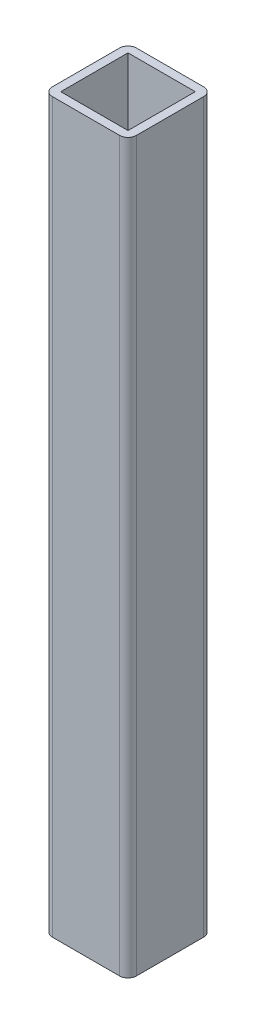
ISO-10303-21;
HEADER;
FILE_DESCRIPTION(('STEP AP214'),'2;1');
FILE_NAME('part.step','',(''),(''),'','','');
FILE_SCHEMA(('AUTOMOTIVE_DESIGN { 1 0 10303 214 1 1 1 1 }'));
ENDSEC;
DATA;
#1=APPLICATION_CONTEXT('core data for automotive mechanical design processes');
#2=APPLICATION_PROTOCOL_DEFINITION('international standard','automotive_design',2000,#1);
#3=PRODUCT_CONTEXT('',#1,'mechanical');
#4=PRODUCT('Part','Part','',(#3));
#5=PRODUCT_RELATED_PRODUCT_CATEGORY('part','',(#4));
#6=PRODUCT_DEFINITION_FORMATION('','',#4);
#7=PRODUCT_DEFINITION_CONTEXT('part definition',#1,'design');
#8=PRODUCT_DEFINITION('design','',#6,#7);
#9=PRODUCT_DEFINITION_SHAPE('','',#8);
#10=(LENGTH_UNIT() NAMED_UNIT(*) SI_UNIT(.MILLI.,.METRE.));
#11=(NAMED_UNIT(*) PLANE_ANGLE_UNIT() SI_UNIT($,.RADIAN.));
#12=(NAMED_UNIT(*) SI_UNIT($,.STERADIAN.) SOLID_ANGLE_UNIT());
#13=UNCERTAINTY_MEASURE_WITH_UNIT(LENGTH_MEASURE(1.E-05),#10,'distance_accuracy_value','');
#14=(GEOMETRIC_REPRESENTATION_CONTEXT(3) GLOBAL_UNCERTAINTY_ASSIGNED_CONTEXT((#13)) GLOBAL_UNIT_ASSIGNED_CONTEXT((#10,
#11,#12)) REPRESENTATION_CONTEXT('',''));
#15=CARTESIAN_POINT('',(0.,0.,0.));
#16=DIRECTION('',(0.,0.,1.));
#17=DIRECTION('',(1.,0.,0.));
#18=AXIS2_PLACEMENT_3D('',#15,#16,#17);
#19=CARTESIAN_POINT('',(-12.,387.934536743125,-53.1201374153035));
#20=DIRECTION('',(0.,1.,0.));
#21=DIRECTION('',(0.,0.,1.));
#22=AXIS2_PLACEMENT_3D('',#19,#20,#21);
#23=CYLINDRICAL_SURFACE('',#22,3.);
#24=CARTESIAN_POINT('',(-12.,647.649993896484,-53.1201374153035));
#25=DIRECTION('',(0.,1.,0.));
#26=DIRECTION('',(0.,0.,1.));
#27=AXIS2_PLACEMENT_3D('',#24,#25,#26);
#28=CIRCLE('',#27,3.);
#29=CARTESIAN_POINT('',(-15.,647.649993896484,-53.1201374153035));
#30=VERTEX_POINT('',#29);
#31=CARTESIAN_POINT('',(-12.,647.649993896484,-50.1201374153035));
#32=VERTEX_POINT('',#31);
#33=EDGE_CURVE('E155',#30,#32,#28,.T.);
#34=ORIENTED_EDGE('',*,*,#33,.F.);
#35=DIRECTION('',(0.,1.,0.));
#36=VECTOR('',#35,1.);
#37=CARTESIAN_POINT('',(-15.,387.934536743125,-53.1201374153035));
#38=LINE('',#37,#36);
#39=CARTESIAN_POINT('',(-15.,387.934536743125,-53.1201374153035));
#40=VERTEX_POINT('',#39);
#41=EDGE_CURVE('E11',#40,#30,#38,.T.);
#42=ORIENTED_EDGE('',*,*,#41,.F.);
#43=CARTESIAN_POINT('',(-12.,387.934536743125,-53.1201374153035));
#44=DIRECTION('',(0.,1.,0.));
#45=DIRECTION('',(0.,0.,1.));
#46=AXIS2_PLACEMENT_3D('',#43,#44,#45);
#47=CIRCLE('',#46,3.);
#48=CARTESIAN_POINT('',(-12.,387.934536743125,-50.1201374153035));
#49=VERTEX_POINT('',#48);
#50=EDGE_CURVE('E159',#40,#49,#47,.T.);
#51=ORIENTED_EDGE('',*,*,#50,.T.);
#52=DIRECTION('',(0.,1.,0.));
#53=VECTOR('',#52,1.);
#54=CARTESIAN_POINT('',(-12.,387.934536743125,-50.1201374153035));
#55=LINE('',#54,#53);
#56=EDGE_CURVE('E36',#49,#32,#55,.T.);
#57=ORIENTED_EDGE('',*,*,#56,.T.);
#58=EDGE_LOOP('',(#34,#42,#51,#57));
#59=FACE_BOUND('',#58,.T.);
#60=ADVANCED_FACE('F33',(#59),#23,.T.);
#61=CARTESIAN_POINT('',(-15.,387.934536743125,-77.1201374153035));
#62=DIRECTION('',(-1.,0.,0.));
#63=DIRECTION('',(0.,0.,1.));
#64=AXIS2_PLACEMENT_3D('',#61,#62,#63);
#65=PLANE('',#64);
#66=DIRECTION('',(0.,0.,1.));
#67=VECTOR('',#66,1.);
#68=CARTESIAN_POINT('',(-15.,647.649993896484,-77.1201374153035));
#69=LINE('',#68,#67);
#70=CARTESIAN_POINT('',(-15.,647.649993896484,-77.1201374153035));
#71=VERTEX_POINT('',#70);
#72=EDGE_CURVE('E163',#71,#30,#69,.T.);
#73=ORIENTED_EDGE('',*,*,#72,.F.);
#74=DIRECTION('',(0.,1.,0.));
#75=VECTOR('',#74,1.);
#76=CARTESIAN_POINT('',(-15.,387.934536743125,-77.1201374153035));
#77=LINE('',#76,#75);
#78=CARTESIAN_POINT('',(-15.,387.934536743125,-77.1201374153035));
#79=VERTEX_POINT('',#78);
#80=EDGE_CURVE('E41',#79,#71,#77,.T.);
#81=ORIENTED_EDGE('',*,*,#80,.F.);
#82=DIRECTION('',(0.,0.,1.));
#83=VECTOR('',#82,1.);
#84=CARTESIAN_POINT('',(-15.,387.934536743125,-77.1201374153035));
#85=LINE('',#84,#83);
#86=EDGE_CURVE('E181',#79,#40,#85,.T.);
#87=ORIENTED_EDGE('',*,*,#86,.T.);
#88=ORIENTED_EDGE('',*,*,#41,.T.);
#89=EDGE_LOOP('',(#73,#81,#87,#88));
#90=FACE_BOUND('',#89,.T.);
#91=ADVANCED_FACE('F228',(#90),#65,.T.);
#92=CARTESIAN_POINT('',(-12.,387.934536743125,-77.1201374153035));
#93=DIRECTION('',(0.,1.,0.));
#94=DIRECTION('',(0.,0.,1.));
#95=AXIS2_PLACEMENT_3D('',#92,#93,#94);
#96=CYLINDRICAL_SURFACE('',#95,2.99999999999999);
#97=CARTESIAN_POINT('',(-12.,647.649993896484,-77.1201374153035));
#98=DIRECTION('',(0.,1.,0.));
#99=DIRECTION('',(0.,0.,1.));
#100=AXIS2_PLACEMENT_3D('',#97,#98,#99);
#101=CIRCLE('',#100,2.99999999999999);
#102=CARTESIAN_POINT('',(-12.,647.649993896484,-80.1201374153035));
#103=VERTEX_POINT('',#102);
#104=EDGE_CURVE('E201',#103,#71,#101,.T.);
#105=ORIENTED_EDGE('',*,*,#104,.F.);
#106=DIRECTION('',(0.,1.,0.));
#107=VECTOR('',#106,1.);
#108=CARTESIAN_POINT('',(-12.,387.934536743125,-80.1201374153035));
#109=LINE('',#108,#107);
#110=CARTESIAN_POINT('',(-12.,387.934536743125,-80.1201374153035));
#111=VERTEX_POINT('',#110);
#112=EDGE_CURVE('E207',#111,#103,#109,.T.);
#113=ORIENTED_EDGE('',*,*,#112,.F.);
#114=CARTESIAN_POINT('',(-12.,387.934536743125,-77.1201374153035));
#115=DIRECTION('',(0.,1.,0.));
#116=DIRECTION('',(0.,0.,1.));
#117=AXIS2_PLACEMENT_3D('',#114,#115,#116);
#118=CIRCLE('',#117,2.99999999999999);
#119=EDGE_CURVE('E178',#111,#79,#118,.T.);
#120=ORIENTED_EDGE('',*,*,#119,.T.);
#121=ORIENTED_EDGE('',*,*,#80,.T.);
#122=EDGE_LOOP('',(#105,#113,#120,#121));
#123=FACE_BOUND('',#122,.T.);
#124=ADVANCED_FACE('F247',(#123),#96,.T.);
#125=CARTESIAN_POINT('',(12.,387.934536743125,-80.1201374153035));
#126=DIRECTION('',(0.,0.,-1.));
#127=DIRECTION('',(-1.,0.,0.));
#128=AXIS2_PLACEMENT_3D('',#125,#126,#127);
#129=PLANE('',#128);
#130=DIRECTION('',(-1.,0.,0.));
#131=VECTOR('',#130,1.);
#132=CARTESIAN_POINT('',(12.,647.649993896484,-80.1201374153035));
#133=LINE('',#132,#131);
#134=CARTESIAN_POINT('',(12.,647.649993896484,-80.1201374153035));
#135=VERTEX_POINT('',#134);
#136=EDGE_CURVE('E198',#135,#103,#133,.T.);
#137=ORIENTED_EDGE('',*,*,#136,.F.);
#138=DIRECTION('',(0.,1.,0.));
#139=VECTOR('',#138,1.);
#140=CARTESIAN_POINT('',(12.,387.934536743125,-80.1201374153035));
#141=LINE('',#140,#139);
#142=CARTESIAN_POINT('',(12.,387.934536743125,-80.1201374153035));
#143=VERTEX_POINT('',#142);
#144=EDGE_CURVE('E209',#143,#135,#141,.T.);
#145=ORIENTED_EDGE('',*,*,#144,.F.);
#146=DIRECTION('',(-1.,0.,0.));
#147=VECTOR('',#146,1.);
#148=CARTESIAN_POINT('',(12.,387.934536743125,-80.1201374153035));
#149=LINE('',#148,#147);
#150=EDGE_CURVE('E175',#143,#111,#149,.T.);
#151=ORIENTED_EDGE('',*,*,#150,.T.);
#152=ORIENTED_EDGE('',*,*,#112,.T.);
#153=EDGE_LOOP('',(#137,#145,#151,#152));
#154=FACE_BOUND('',#153,.T.);
#155=ADVANCED_FACE('F245',(#154),#129,.T.);
#156=CARTESIAN_POINT('',(12.,387.934536743125,-77.1201374153035));
#157=DIRECTION('',(0.,1.,0.));
#158=DIRECTION('',(0.,0.,1.));
#159=AXIS2_PLACEMENT_3D('',#156,#157,#158);
#160=CYLINDRICAL_SURFACE('',#159,2.99999999999999);
#161=CARTESIAN_POINT('',(12.,647.649993896484,-77.1201374153035));
#162=DIRECTION('',(0.,1.,0.));
#163=DIRECTION('',(0.,0.,1.));
#164=AXIS2_PLACEMENT_3D('',#161,#162,#163);
#165=CIRCLE('',#164,2.99999999999999);
#166=CARTESIAN_POINT('',(15.,647.649993896484,-77.1201374153035));
#167=VERTEX_POINT('',#166);
#168=EDGE_CURVE('E195',#167,#135,#165,.T.);
#169=ORIENTED_EDGE('',*,*,#168,.F.);
#170=DIRECTION('',(0.,1.,0.));
#171=VECTOR('',#170,1.);
#172=CARTESIAN_POINT('',(15.,387.934536743125,-77.1201374153035));
#173=LINE('',#172,#171);
#174=CARTESIAN_POINT('',(15.,387.934536743125,-77.1201374153035));
#175=VERTEX_POINT('',#174);
#176=EDGE_CURVE('E211',#175,#167,#173,.T.);
#177=ORIENTED_EDGE('',*,*,#176,.F.);
#178=CARTESIAN_POINT('',(12.,387.934536743125,-77.1201374153035));
#179=DIRECTION('',(0.,1.,0.));
#180=DIRECTION('',(0.,0.,1.));
#181=AXIS2_PLACEMENT_3D('',#178,#179,#180);
#182=CIRCLE('',#181,2.99999999999999);
#183=EDGE_CURVE('E172',#175,#143,#182,.T.);
#184=ORIENTED_EDGE('',*,*,#183,.T.);
#185=ORIENTED_EDGE('',*,*,#144,.T.);
#186=EDGE_LOOP('',(#169,#177,#184,#185));
#187=FACE_BOUND('',#186,.T.);
#188=ADVANCED_FACE('F241',(#187),#160,.T.);
#189=CARTESIAN_POINT('',(15.,387.934536743125,-53.1201374153035));
#190=DIRECTION('',(1.,0.,0.));
#191=DIRECTION('',(0.,0.,-1.));
#192=AXIS2_PLACEMENT_3D('',#189,#190,#191);
#193=PLANE('',#192);
#194=DIRECTION('',(0.,0.,-1.));
#195=VECTOR('',#194,1.);
#196=CARTESIAN_POINT('',(15.,647.649993896484,-53.1201374153035));
#197=LINE('',#196,#195);
#198=CARTESIAN_POINT('',(15.,647.649993896484,-53.1201374153035));
#199=VERTEX_POINT('',#198);
#200=EDGE_CURVE('E192',#199,#167,#197,.T.);
#201=ORIENTED_EDGE('',*,*,#200,.F.);
#202=DIRECTION('',(0.,1.,0.));
#203=VECTOR('',#202,1.);
#204=CARTESIAN_POINT('',(15.,387.934536743125,-53.1201374153035));
#205=LINE('',#204,#203);
#206=CARTESIAN_POINT('',(15.,387.934536743125,-53.1201374153035));
#207=VERTEX_POINT('',#206);
#208=EDGE_CURVE('E213',#207,#199,#205,.T.);
#209=ORIENTED_EDGE('',*,*,#208,.F.);
#210=DIRECTION('',(0.,0.,-1.));
#211=VECTOR('',#210,1.);
#212=CARTESIAN_POINT('',(15.,387.934536743125,-53.1201374153035));
#213=LINE('',#212,#211);
#214=EDGE_CURVE('E169',#207,#175,#213,.T.);
#215=ORIENTED_EDGE('',*,*,#214,.T.);
#216=ORIENTED_EDGE('',*,*,#176,.T.);
#217=EDGE_LOOP('',(#201,#209,#215,#216));
#218=FACE_BOUND('',#217,.T.);
#219=ADVANCED_FACE('F239',(#218),#193,.T.);
#220=CARTESIAN_POINT('',(12.,387.934536743125,-53.1201374153035));
#221=DIRECTION('',(0.,1.,0.));
#222=DIRECTION('',(0.,0.,1.));
#223=AXIS2_PLACEMENT_3D('',#220,#221,#222);
#224=CYLINDRICAL_SURFACE('',#223,3.);
#225=CARTESIAN_POINT('',(12.,647.649993896484,-53.1201374153035));
#226=DIRECTION('',(0.,1.,0.));
#227=DIRECTION('',(0.,0.,1.));
#228=AXIS2_PLACEMENT_3D('',#225,#226,#227);
#229=CIRCLE('',#228,3.);
#230=CARTESIAN_POINT('',(12.,647.649993896484,-50.1201374153035));
#231=VERTEX_POINT('',#230);
#232=EDGE_CURVE('E189',#231,#199,#229,.T.);
#233=ORIENTED_EDGE('',*,*,#232,.F.);
#234=DIRECTION('',(0.,1.,0.));
#235=VECTOR('',#234,1.);
#236=CARTESIAN_POINT('',(12.,387.934536743125,-50.1201374153035));
#237=LINE('',#236,#235);
#238=CARTESIAN_POINT('',(12.,387.934536743125,-50.1201374153035));
#239=VERTEX_POINT('',#238);
#240=EDGE_CURVE('E214',#239,#231,#237,.T.);
#241=ORIENTED_EDGE('',*,*,#240,.F.);
#242=CARTESIAN_POINT('',(12.,387.934536743125,-53.1201374153035));
#243=DIRECTION('',(0.,1.,0.));
#244=DIRECTION('',(0.,0.,1.));
#245=AXIS2_PLACEMENT_3D('',#242,#243,#244);
#246=CIRCLE('',#245,3.);
#247=EDGE_CURVE('E166',#239,#207,#246,.T.);
#248=ORIENTED_EDGE('',*,*,#247,.T.);
#249=ORIENTED_EDGE('',*,*,#208,.T.);
#250=EDGE_LOOP('',(#233,#241,#248,#249));
#251=FACE_BOUND('',#250,.T.);
#252=ADVANCED_FACE('F235',(#251),#224,.T.);
#253=CARTESIAN_POINT('',(-12.,387.934536743125,-50.1201374153035));
#254=DIRECTION('',(0.,0.,1.));
#255=DIRECTION('',(1.,0.,0.));
#256=AXIS2_PLACEMENT_3D('',#253,#254,#255);
#257=PLANE('',#256);
#258=DIRECTION('',(1.,0.,0.));
#259=VECTOR('',#258,1.);
#260=CARTESIAN_POINT('',(-12.,647.649993896484,-50.1201374153035));
#261=LINE('',#260,#259);
#262=EDGE_CURVE('E186',#32,#231,#261,.T.);
#263=ORIENTED_EDGE('',*,*,#262,.F.);
#264=ORIENTED_EDGE('',*,*,#56,.F.);
#265=DIRECTION('',(1.,0.,0.));
#266=VECTOR('',#265,1.);
#267=CARTESIAN_POINT('',(-12.,387.934536743125,-50.1201374153035));
#268=LINE('',#267,#266);
#269=EDGE_CURVE('E162',#49,#239,#268,.T.);
#270=ORIENTED_EDGE('',*,*,#269,.T.);
#271=ORIENTED_EDGE('',*,*,#240,.T.);
#272=EDGE_LOOP('',(#263,#264,#270,#271));
#273=FACE_BOUND('',#272,.T.);
#274=ADVANCED_FACE('F222',(#273),#257,.T.);
#275=CARTESIAN_POINT('',(-12.,387.934536743125,-53.1201374153035));
#276=DIRECTION('',(0.,1.,0.));
#277=DIRECTION('',(0.,0.,1.));
#278=AXIS2_PLACEMENT_3D('',#275,#276,#277);
#279=PLANE('',#278);
#280=DIRECTION('',(1.,0.,0.));
#281=VECTOR('',#280,1.);
#282=CARTESIAN_POINT('',(12.,387.934536743125,-53.1201374153035));
#283=LINE('',#282,#281);
#284=CARTESIAN_POINT('',(-12.,387.934536743125,-53.1201374153035));
#285=VERTEX_POINT('',#284);
#286=CARTESIAN_POINT('',(12.,387.934536743125,-53.1201374153035));
#287=VERTEX_POINT('',#286);
#288=EDGE_CURVE('E130',#285,#287,#283,.T.);
#289=ORIENTED_EDGE('',*,*,#288,.T.);
#290=DIRECTION('',(0.,0.,-1.));
#291=VECTOR('',#290,1.);
#292=CARTESIAN_POINT('',(12.,387.934536743125,-77.1201374153035));
#293=LINE('',#292,#291);
#294=CARTESIAN_POINT('',(12.,387.934536743125,-77.1201374153035));
#295=VERTEX_POINT('',#294);
#296=EDGE_CURVE('E124',#287,#295,#293,.T.);
#297=ORIENTED_EDGE('',*,*,#296,.T.);
#298=DIRECTION('',(-1.,0.,0.));
#299=VECTOR('',#298,1.);
#300=CARTESIAN_POINT('',(-12.,387.934536743125,-77.1201374153035));
#301=LINE('',#300,#299);
#302=CARTESIAN_POINT('',(-12.,387.934536743125,-77.1201374153035));
#303=VERTEX_POINT('',#302);
#304=EDGE_CURVE('E133',#295,#303,#301,.T.);
#305=ORIENTED_EDGE('',*,*,#304,.T.);
#306=DIRECTION('',(0.,0.,1.));
#307=VECTOR('',#306,1.);
#308=CARTESIAN_POINT('',(-12.,387.934536743125,-53.1201374153035));
#309=LINE('',#308,#307);
#310=EDGE_CURVE('E49',#303,#285,#309,.T.);
#311=ORIENTED_EDGE('',*,*,#310,.T.);
#312=EDGE_LOOP('',(#289,#297,#305,#311));
#313=FACE_BOUND('',#312,.T.);
#314=ORIENTED_EDGE('',*,*,#50,.F.);
#315=ORIENTED_EDGE('',*,*,#86,.F.);
#316=ORIENTED_EDGE('',*,*,#119,.F.);
#317=ORIENTED_EDGE('',*,*,#150,.F.);
#318=ORIENTED_EDGE('',*,*,#183,.F.);
#319=ORIENTED_EDGE('',*,*,#214,.F.);
#320=ORIENTED_EDGE('',*,*,#247,.F.);
#321=ORIENTED_EDGE('',*,*,#269,.F.);
#322=EDGE_LOOP('',(#314,#315,#316,#317,#318,#319,#320,#321));
#323=FACE_BOUND('',#322,.T.);
#324=ADVANCED_FACE('F137',(#313,#323),#279,.F.);
#325=CARTESIAN_POINT('',(-12.,647.649993896484,-53.1201374153035));
#326=DIRECTION('',(0.,1.,0.));
#327=DIRECTION('',(0.,0.,1.));
#328=AXIS2_PLACEMENT_3D('',#325,#326,#327);
#329=PLANE('',#328);
#330=DIRECTION('',(0.,0.,-1.));
#331=VECTOR('',#330,1.);
#332=CARTESIAN_POINT('',(12.,647.649993896484,-77.1201374153035));
#333=LINE('',#332,#331);
#334=CARTESIAN_POINT('',(12.,647.649993896484,-53.1201374153035));
#335=VERTEX_POINT('',#334);
#336=CARTESIAN_POINT('',(12.,647.649993896484,-77.1201374153035));
#337=VERTEX_POINT('',#336);
#338=EDGE_CURVE('E57',#335,#337,#333,.T.);
#339=ORIENTED_EDGE('',*,*,#338,.F.);
#340=DIRECTION('',(1.,0.,0.));
#341=VECTOR('',#340,1.);
#342=CARTESIAN_POINT('',(12.,647.649993896484,-53.1201374153035));
#343=LINE('',#342,#341);
#344=CARTESIAN_POINT('',(-12.,647.649993896484,-53.1201374153035));
#345=VERTEX_POINT('',#344);
#346=EDGE_CURVE('E140',#345,#335,#343,.T.);
#347=ORIENTED_EDGE('',*,*,#346,.F.);
#348=DIRECTION('',(0.,0.,1.));
#349=VECTOR('',#348,1.);
#350=CARTESIAN_POINT('',(-12.,647.649993896484,-53.1201374153035));
#351=LINE('',#350,#349);
#352=CARTESIAN_POINT('',(-12.,647.649993896484,-77.1201374153035));
#353=VERTEX_POINT('',#352);
#354=EDGE_CURVE('E143',#353,#345,#351,.T.);
#355=ORIENTED_EDGE('',*,*,#354,.F.);
#356=DIRECTION('',(-1.,0.,0.));
#357=VECTOR('',#356,1.);
#358=CARTESIAN_POINT('',(-12.,647.649993896484,-77.1201374153035));
#359=LINE('',#358,#357);
#360=EDGE_CURVE('E149',#337,#353,#359,.T.);
#361=ORIENTED_EDGE('',*,*,#360,.F.);
#362=EDGE_LOOP('',(#339,#347,#355,#361));
#363=FACE_BOUND('',#362,.T.);
#364=ORIENTED_EDGE('',*,*,#33,.T.);
#365=ORIENTED_EDGE('',*,*,#262,.T.);
#366=ORIENTED_EDGE('',*,*,#232,.T.);
#367=ORIENTED_EDGE('',*,*,#200,.T.);
#368=ORIENTED_EDGE('',*,*,#168,.T.);
#369=ORIENTED_EDGE('',*,*,#136,.T.);
#370=ORIENTED_EDGE('',*,*,#104,.T.);
#371=ORIENTED_EDGE('',*,*,#72,.T.);
#372=EDGE_LOOP('',(#364,#365,#366,#367,#368,#369,#370,#371));
#373=FACE_BOUND('',#372,.T.);
#374=ADVANCED_FACE('F224',(#363,#373),#329,.T.);
#375=CARTESIAN_POINT('',(12.,387.934536743125,-77.1201374153035));
#376=DIRECTION('',(1.,0.,0.));
#377=DIRECTION('',(0.,0.,-1.));
#378=AXIS2_PLACEMENT_3D('',#375,#376,#377);
#379=PLANE('',#378);
#380=ORIENTED_EDGE('',*,*,#338,.T.);
#381=DIRECTION('',(0.,1.,0.));
#382=VECTOR('',#381,1.);
#383=CARTESIAN_POINT('',(12.,387.934536743125,-77.1201374153035));
#384=LINE('',#383,#382);
#385=EDGE_CURVE('E120',#295,#337,#384,.T.);
#386=ORIENTED_EDGE('',*,*,#385,.F.);
#387=ORIENTED_EDGE('',*,*,#296,.F.);
#388=DIRECTION('',(0.,1.,0.));
#389=VECTOR('',#388,1.);
#390=CARTESIAN_POINT('',(12.,387.934536743125,-53.1201374153035));
#391=LINE('',#390,#389);
#392=EDGE_CURVE('E153',#287,#335,#391,.T.);
#393=ORIENTED_EDGE('',*,*,#392,.T.);
#394=EDGE_LOOP('',(#380,#386,#387,#393));
#395=FACE_BOUND('',#394,.T.);
#396=ADVANCED_FACE('F122',(#395),#379,.F.);
#397=CARTESIAN_POINT('',(12.,387.934536743125,-53.1201374153035));
#398=DIRECTION('',(0.,0.,1.));
#399=DIRECTION('',(1.,0.,0.));
#400=AXIS2_PLACEMENT_3D('',#397,#398,#399);
#401=PLANE('',#400);
#402=ORIENTED_EDGE('',*,*,#346,.T.);
#403=ORIENTED_EDGE('',*,*,#392,.F.);
#404=ORIENTED_EDGE('',*,*,#288,.F.);
#405=DIRECTION('',(0.,1.,0.));
#406=VECTOR('',#405,1.);
#407=CARTESIAN_POINT('',(-12.,387.934536743125,-53.1201374153035));
#408=LINE('',#407,#406);
#409=EDGE_CURVE('E156',#285,#345,#408,.T.);
#410=ORIENTED_EDGE('',*,*,#409,.T.);
#411=EDGE_LOOP('',(#402,#403,#404,#410));
#412=FACE_BOUND('',#411,.T.);
#413=ADVANCED_FACE('F330',(#412),#401,.F.);
#414=CARTESIAN_POINT('',(-12.,387.934536743125,-53.1201374153035));
#415=DIRECTION('',(-1.,0.,0.));
#416=DIRECTION('',(0.,0.,1.));
#417=AXIS2_PLACEMENT_3D('',#414,#415,#416);
#418=PLANE('',#417);
#419=ORIENTED_EDGE('',*,*,#354,.T.);
#420=ORIENTED_EDGE('',*,*,#409,.F.);
#421=ORIENTED_EDGE('',*,*,#310,.F.);
#422=DIRECTION('',(0.,1.,0.));
#423=VECTOR('',#422,1.);
#424=CARTESIAN_POINT('',(-12.,387.934536743125,-77.1201374153035));
#425=LINE('',#424,#423);
#426=EDGE_CURVE('E129',#303,#353,#425,.T.);
#427=ORIENTED_EDGE('',*,*,#426,.T.);
#428=EDGE_LOOP('',(#419,#420,#421,#427));
#429=FACE_BOUND('',#428,.T.);
#430=ADVANCED_FACE('F339',(#429),#418,.F.);
#431=CARTESIAN_POINT('',(-12.,387.934536743125,-77.1201374153035));
#432=DIRECTION('',(0.,0.,-1.));
#433=DIRECTION('',(-1.,0.,0.));
#434=AXIS2_PLACEMENT_3D('',#431,#432,#433);
#435=PLANE('',#434);
#436=ORIENTED_EDGE('',*,*,#360,.T.);
#437=ORIENTED_EDGE('',*,*,#426,.F.);
#438=ORIENTED_EDGE('',*,*,#304,.F.);
#439=ORIENTED_EDGE('',*,*,#385,.T.);
#440=EDGE_LOOP('',(#436,#437,#438,#439));
#441=FACE_BOUND('',#440,.T.);
#442=ADVANCED_FACE('F134',(#441),#435,.F.);
#443=CLOSED_SHELL('',(#60,#91,#124,#155,#188,#219,#252,#274,#324,#374,#396,#413,#430,#442));
#444=MANIFOLD_SOLID_BREP('B2',#443);
#445=ADVANCED_BREP_SHAPE_REPRESENTATION('',(#18,#444),#14);
#446=SHAPE_DEFINITION_REPRESENTATION(#9,#445);
ENDSEC;
END-ISO-10303-21;
